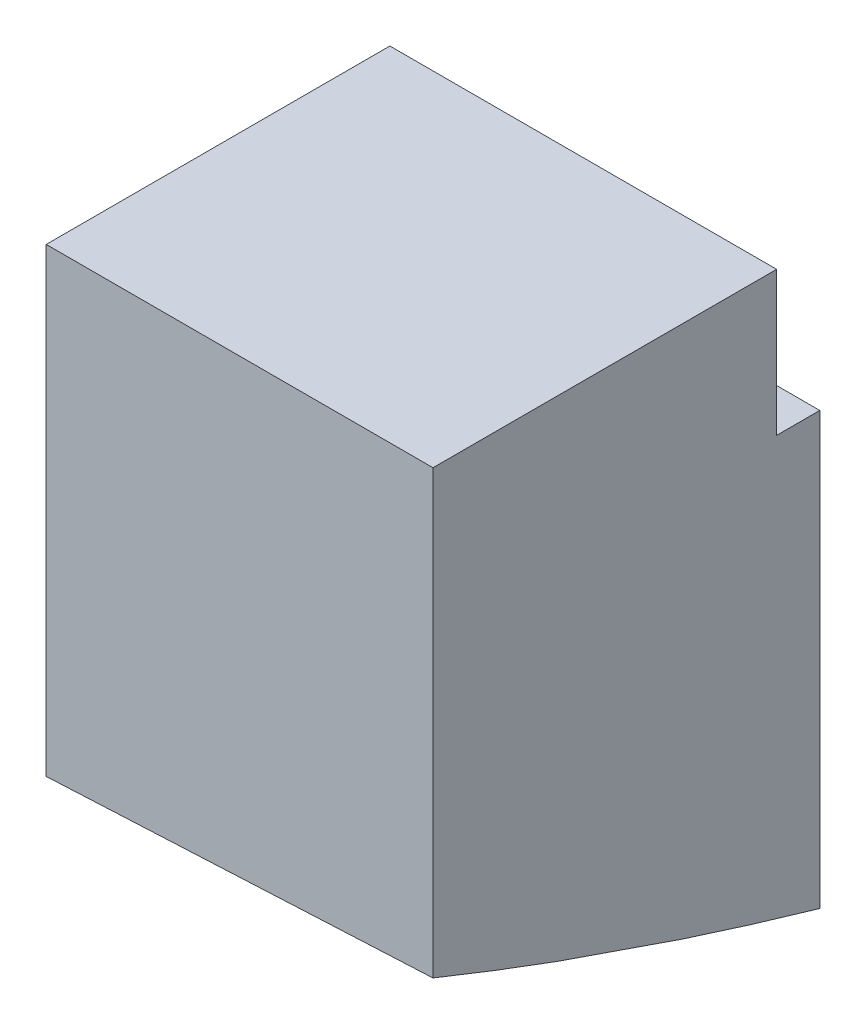
ISO-10303-21;
HEADER;
FILE_DESCRIPTION(('STEP AP214'),'2;1');
FILE_NAME('part.step','',(''),(''),'','','');
FILE_SCHEMA(('AUTOMOTIVE_DESIGN { 1 0 10303 214 1 1 1 1 }'));
ENDSEC;
DATA;
#1=APPLICATION_CONTEXT('core data for automotive mechanical design processes');
#2=APPLICATION_PROTOCOL_DEFINITION('international standard','automotive_design',2000,#1);
#3=PRODUCT_CONTEXT('',#1,'mechanical');
#4=PRODUCT('Part','Part','',(#3));
#5=PRODUCT_RELATED_PRODUCT_CATEGORY('part','',(#4));
#6=PRODUCT_DEFINITION_FORMATION('','',#4);
#7=PRODUCT_DEFINITION_CONTEXT('part definition',#1,'design');
#8=PRODUCT_DEFINITION('design','',#6,#7);
#9=PRODUCT_DEFINITION_SHAPE('','',#8);
#10=(LENGTH_UNIT() NAMED_UNIT(*) SI_UNIT(.MILLI.,.METRE.));
#11=(NAMED_UNIT(*) PLANE_ANGLE_UNIT() SI_UNIT($,.RADIAN.));
#12=(NAMED_UNIT(*) SI_UNIT($,.STERADIAN.) SOLID_ANGLE_UNIT());
#13=UNCERTAINTY_MEASURE_WITH_UNIT(LENGTH_MEASURE(1.E-05),#10,'distance_accuracy_value','');
#14=(GEOMETRIC_REPRESENTATION_CONTEXT(3) GLOBAL_UNCERTAINTY_ASSIGNED_CONTEXT((#13)) GLOBAL_UNIT_ASSIGNED_CONTEXT((#10,
#11,#12)) REPRESENTATION_CONTEXT('',''));
#15=CARTESIAN_POINT('',(0.,0.,0.));
#16=DIRECTION('',(0.,0.,1.));
#17=DIRECTION('',(1.,0.,0.));
#18=AXIS2_PLACEMENT_3D('',#15,#16,#17);
#19=CARTESIAN_POINT('',(0.,50.,0.));
#20=DIRECTION('',(-1.,0.,0.));
#21=DIRECTION('',(0.,0.,1.));
#22=AXIS2_PLACEMENT_3D('',#19,#20,#21);
#23=PLANE('',#22);
#24=DIRECTION('',(0.,-1.,0.));
#25=VECTOR('',#24,1.);
#26=CARTESIAN_POINT('',(0.,50.,0.));
#27=LINE('',#26,#25);
#28=CARTESIAN_POINT('',(0.,50.,0.));
#29=VERTEX_POINT('',#28);
#30=CARTESIAN_POINT('',(0.,19.2653746238792,0.));
#31=VERTEX_POINT('',#30);
#32=EDGE_CURVE('E208',#29,#31,#27,.T.);
#33=ORIENTED_EDGE('',*,*,#32,.T.);
#34=CARTESIAN_POINT('',(0.,19.2653746238792,0.));
#35=CARTESIAN_POINT('',(0.,18.9684224645422,-0.7333824682246));
#36=CARTESIAN_POINT('',(0.,18.6748267536164,-1.46812334043614));
#37=CARTESIAN_POINT('',(0.,18.0944288090762,-2.93995406986249));
#38=CARTESIAN_POINT('',(0.,17.8076239835433,-3.67704290494985));
#39=CARTESIAN_POINT('',(0.,17.24074456179,-5.15354552273353));
#40=CARTESIAN_POINT('',(0.,16.9606679368519,-5.8929585266196));
#41=CARTESIAN_POINT('',(0.,16.4071820554607,-7.37408605737633));
#42=CARTESIAN_POINT('',(0.,16.1337713135788,-8.11580002919308));
#43=CARTESIAN_POINT('',(0.,15.5935553991767,-9.60150635757827));
#44=CARTESIAN_POINT('',(0.,15.3267492645535,-10.3454983643469));
#45=CARTESIAN_POINT('',(0.,14.799681622901,-11.8357379885373));
#46=CARTESIAN_POINT('',(0.,14.5394196573909,-12.5819854438171));
#47=CARTESIAN_POINT('',(0.,14.0253865175721,-14.0766954498029));
#48=CARTESIAN_POINT('',(0.,13.7716152120891,-14.8251579554017));
#49=CARTESIAN_POINT('',(0.,13.2704965915861,-16.3242971547451));
#50=CARTESIAN_POINT('',(0.,13.0231497949205,-17.0749740217453));
#51=CARTESIAN_POINT('',(0.,12.5348209409062,-18.5785232406956));
#52=CARTESIAN_POINT('',(0.,12.2938398737778,-19.3313959142231));
#53=CARTESIAN_POINT('',(0.,11.818184147999,-20.8393183758254));
#54=CARTESIAN_POINT('',(0.,11.5835109321355,-21.5943686189713));
#55=CARTESIAN_POINT('',(0.,11.1204135825164,-23.1066280514065));
#56=CARTESIAN_POINT('',(0.,10.8919913251946,-23.8638378152352));
#57=CARTESIAN_POINT('',(0.,10.4413391600996,-25.3803987759119));
#58=CARTESIAN_POINT('',(0.,10.2191115437309,-26.1397506536947));
#59=CARTESIAN_POINT('',(0.,10.0000000057557,-26.9));
#60=B_SPLINE_CURVE_WITH_KNOTS('',3,(#34,#35,#36,#37,#38,#39,#40,#41,#42,#43,#44,#45,#46,#47,#48,
#49,#50,#51,#52,#53,#54,#55,#56,#57,#58,#59),.UNSPECIFIED.,.F.,.F.,(4,2,2,2,2,2,2,2,2,2,2,2,4),
(0.,2.37365337624956,4.74638568519725,7.11839334153588,9.48986749565518,11.8609941361147,
14.2319541913002,16.6028662921749,18.9739690969661,21.3454385919225,23.717445972261,
26.0901577482283,28.4637358495514),.UNSPECIFIED.);
#61=CARTESIAN_POINT('',(0.,9.99999997053023,-26.9000001221872));
#62=VERTEX_POINT('',#61);
#63=EDGE_CURVE('E143',#31,#62,#60,.T.);
#64=ORIENTED_EDGE('',*,*,#63,.T.);
#65=DIRECTION('',(0.,-1.,0.));
#66=VECTOR('',#65,1.);
#67=CARTESIAN_POINT('',(0.,50.,-26.9));
#68=LINE('',#67,#66);
#69=CARTESIAN_POINT('',(0.,40.,-26.9));
#70=VERTEX_POINT('',#69);
#71=EDGE_CURVE('E198',#70,#62,#68,.T.);
#72=ORIENTED_EDGE('',*,*,#71,.F.);
#73=DIRECTION('',(0.,0.,-1.));
#74=VECTOR('',#73,1.);
#75=CARTESIAN_POINT('',(0.,40.,-26.9));
#76=LINE('',#75,#74);
#77=CARTESIAN_POINT('',(0.,40.,-23.9));
#78=VERTEX_POINT('',#77);
#79=EDGE_CURVE('E225',#78,#70,#76,.T.);
#80=ORIENTED_EDGE('',*,*,#79,.F.);
#81=DIRECTION('',(0.,-1.,0.));
#82=VECTOR('',#81,1.);
#83=CARTESIAN_POINT('',(0.,40.,-23.9));
#84=LINE('',#83,#82);
#85=CARTESIAN_POINT('',(0.,50.,-23.9));
#86=VERTEX_POINT('',#85);
#87=EDGE_CURVE('E216',#86,#78,#84,.T.);
#88=ORIENTED_EDGE('',*,*,#87,.F.);
#89=DIRECTION('',(0.,0.,-1.));
#90=VECTOR('',#89,1.);
#91=CARTESIAN_POINT('',(0.,50.,0.));
#92=LINE('',#91,#90);
#93=EDGE_CURVE('E224',#29,#86,#92,.T.);
#94=ORIENTED_EDGE('',*,*,#93,.F.);
#95=EDGE_LOOP('',(#33,#64,#72,#80,#88,#94));
#96=FACE_BOUND('',#95,.T.);
#97=ADVANCED_FACE('F121',(#96),#23,.F.);
#98=CARTESIAN_POINT('',(0.,50.,-26.9));
#99=DIRECTION('',(0.,0.,1.));
#100=DIRECTION('',(1.,0.,0.));
#101=AXIS2_PLACEMENT_3D('',#98,#99,#100);
#102=PLANE('',#101);
#103=ORIENTED_EDGE('',*,*,#71,.T.);
#104=DIRECTION('',(1.,1.75165169890955E-10,7.2411619053903E-10));
#105=VECTOR('',#104,1.);
#106=CARTESIAN_POINT('',(13.4001487039591,9.99999997287747,-26.900000112484));
#107=LINE('',#106,#105);
#108=CARTESIAN_POINT('',(-26.9,9.99999996583627,-26.9000001416687));
#109=VERTEX_POINT('',#108);
#110=EDGE_CURVE('E183',#109,#62,#107,.T.);
#111=ORIENTED_EDGE('',*,*,#110,.F.);
#112=DIRECTION('',(0.,-1.,0.));
#113=VECTOR('',#112,1.);
#114=CARTESIAN_POINT('',(-26.9,50.,-26.9));
#115=LINE('',#114,#113);
#116=CARTESIAN_POINT('',(-26.9,40.,-26.9));
#117=VERTEX_POINT('',#116);
#118=EDGE_CURVE('E196',#117,#109,#115,.T.);
#119=ORIENTED_EDGE('',*,*,#118,.F.);
#120=DIRECTION('',(1.,0.,0.));
#121=VECTOR('',#120,1.);
#122=CARTESIAN_POINT('',(-40.,40.,-26.9));
#123=LINE('',#122,#121);
#124=EDGE_CURVE('E361',#117,#70,#123,.T.);
#125=ORIENTED_EDGE('',*,*,#124,.T.);
#126=EDGE_LOOP('',(#103,#111,#119,#125));
#127=FACE_BOUND('',#126,.T.);
#128=ADVANCED_FACE('F194',(#127),#102,.F.);
#129=CARTESIAN_POINT('',(-26.9,50.,0.));
#130=DIRECTION('',(1.,0.,0.));
#131=DIRECTION('',(0.,0.,-1.));
#132=AXIS2_PLACEMENT_3D('',#129,#130,#131);
#133=PLANE('',#132);
#134=ORIENTED_EDGE('',*,*,#118,.T.);
#135=CARTESIAN_POINT('',(-26.9,9.99999996583627,-26.9000001416687));
#136=CARTESIAN_POINT('',(-26.9,26.0746138693979,40.0228375132252));
#137=CARTESIAN_POINT('',(-26.9,63.907947180476,90.1089803414481));
#138=CARTESIAN_POINT('',(-26.9,123.499999899071,123.358428343));
#139=B_SPLINE_CURVE_WITH_KNOTS('',3,(#135,#136,#137,#138),.UNSPECIFIED.,.F.,.F.,(4,4),(0.,1.),.UNSPECIFIED.);
#140=CARTESIAN_POINT('',(-26.9,17.9533273908,0.));
#141=VERTEX_POINT('',#140);
#142=EDGE_CURVE('E180',#109,#141,#139,.T.);
#143=ORIENTED_EDGE('',*,*,#142,.T.);
#144=DIRECTION('',(0.,-1.,0.));
#145=VECTOR('',#144,1.);
#146=CARTESIAN_POINT('',(-26.9,50.,0.));
#147=LINE('',#146,#145);
#148=CARTESIAN_POINT('',(-26.9,50.,0.));
#149=VERTEX_POINT('',#148);
#150=EDGE_CURVE('E203',#149,#141,#147,.T.);
#151=ORIENTED_EDGE('',*,*,#150,.F.);
#152=DIRECTION('',(0.,0.,1.));
#153=VECTOR('',#152,1.);
#154=CARTESIAN_POINT('',(-26.9,50.,0.));
#155=LINE('',#154,#153);
#156=CARTESIAN_POINT('',(-26.9,50.,-23.9));
#157=VERTEX_POINT('',#156);
#158=EDGE_CURVE('E233',#157,#149,#155,.T.);
#159=ORIENTED_EDGE('',*,*,#158,.F.);
#160=DIRECTION('',(0.,-1.,0.));
#161=VECTOR('',#160,1.);
#162=CARTESIAN_POINT('',(-26.9,50.,-23.9));
#163=LINE('',#162,#161);
#164=CARTESIAN_POINT('',(-26.9,40.,-23.9));
#165=VERTEX_POINT('',#164);
#166=EDGE_CURVE('E151',#157,#165,#163,.T.);
#167=ORIENTED_EDGE('',*,*,#166,.T.);
#168=DIRECTION('',(0.,0.,-1.));
#169=VECTOR('',#168,1.);
#170=CARTESIAN_POINT('',(-26.9,40.,0.));
#171=LINE('',#170,#169);
#172=EDGE_CURVE('E51',#165,#117,#171,.T.);
#173=ORIENTED_EDGE('',*,*,#172,.T.);
#174=EDGE_LOOP('',(#134,#143,#151,#159,#167,#173));
#175=FACE_BOUND('',#174,.T.);
#176=ADVANCED_FACE('F201',(#175),#133,.F.);
#177=CARTESIAN_POINT('',(0.,50.,0.));
#178=DIRECTION('',(0.,0.,-1.));
#179=DIRECTION('',(-1.,0.,0.));
#180=AXIS2_PLACEMENT_3D('',#177,#178,#179);
#181=PLANE('',#180);
#182=ORIENTED_EDGE('',*,*,#150,.T.);
#183=CARTESIAN_POINT('',(-26.9,17.9533273908,0.));
#184=CARTESIAN_POINT('',(-22.416549526997,18.1696002957464,0.));
#185=CARTESIAN_POINT('',(-17.9331576238289,18.3870740176429,0.));
#186=CARTESIAN_POINT('',(-8.96649095716219,18.8244230953359,0.));
#187=CARTESIAN_POINT('',(-4.48321619366368,19.0442984511325,0.));
#188=CARTESIAN_POINT('',(0.,19.2653746238792,0.));
#189=B_SPLINE_CURVE_WITH_KNOTS('',3,(#183,#184,#185,#186,#187,#188),.UNSPECIFIED.,.F.,.F.,(4,2,
4),(0.,13.4659897517406,26.9319795034813),.UNSPECIFIED.);
#190=EDGE_CURVE('E184',#141,#31,#189,.T.);
#191=ORIENTED_EDGE('',*,*,#190,.T.);
#192=ORIENTED_EDGE('',*,*,#32,.F.);
#193=DIRECTION('',(1.,0.,0.));
#194=VECTOR('',#193,1.);
#195=CARTESIAN_POINT('',(0.,50.,0.));
#196=LINE('',#195,#194);
#197=EDGE_CURVE('E230',#149,#29,#196,.T.);
#198=ORIENTED_EDGE('',*,*,#197,.F.);
#199=EDGE_LOOP('',(#182,#191,#192,#198));
#200=FACE_BOUND('',#199,.T.);
#201=ADVANCED_FACE('F246',(#200),#181,.F.);
#202=CARTESIAN_POINT('',(0.,50.,0.));
#203=DIRECTION('',(0.,1.,0.));
#204=DIRECTION('',(0.,0.,1.));
#205=AXIS2_PLACEMENT_3D('',#202,#203,#204);
#206=PLANE('',#205);
#207=DIRECTION('',(1.,0.,0.));
#208=VECTOR('',#207,1.);
#209=CARTESIAN_POINT('',(0.,50.,-23.9));
#210=LINE('',#209,#208);
#211=EDGE_CURVE('E136',#157,#86,#210,.T.);
#212=ORIENTED_EDGE('',*,*,#211,.F.);
#213=ORIENTED_EDGE('',*,*,#158,.T.);
#214=ORIENTED_EDGE('',*,*,#197,.T.);
#215=ORIENTED_EDGE('',*,*,#93,.T.);
#216=EDGE_LOOP('',(#212,#213,#214,#215));
#217=FACE_BOUND('',#216,.T.);
#218=ADVANCED_FACE('F228',(#217),#206,.T.);
#219=CARTESIAN_POINT('',(-40.,40.,-26.9));
#220=DIRECTION('',(0.,-1.,0.));
#221=DIRECTION('',(0.,0.,-1.));
#222=AXIS2_PLACEMENT_3D('',#219,#220,#221);
#223=PLANE('',#222);
#224=DIRECTION('',(1.,0.,0.));
#225=VECTOR('',#224,1.);
#226=CARTESIAN_POINT('',(-40.,40.,-23.9));
#227=LINE('',#226,#225);
#228=EDGE_CURVE('E359',#165,#78,#227,.T.);
#229=ORIENTED_EDGE('',*,*,#228,.T.);
#230=ORIENTED_EDGE('',*,*,#79,.T.);
#231=ORIENTED_EDGE('',*,*,#124,.F.);
#232=ORIENTED_EDGE('',*,*,#172,.F.);
#233=EDGE_LOOP('',(#229,#230,#231,#232));
#234=FACE_BOUND('',#233,.T.);
#235=ADVANCED_FACE('F272',(#234),#223,.F.);
#236=CARTESIAN_POINT('',(-40.,40.,-23.9));
#237=DIRECTION('',(0.,0.,1.));
#238=DIRECTION('',(1.,0.,0.));
#239=AXIS2_PLACEMENT_3D('',#236,#237,#238);
#240=PLANE('',#239);
#241=ORIENTED_EDGE('',*,*,#211,.T.);
#242=ORIENTED_EDGE('',*,*,#87,.T.);
#243=ORIENTED_EDGE('',*,*,#228,.F.);
#244=ORIENTED_EDGE('',*,*,#166,.F.);
#245=EDGE_LOOP('',(#241,#242,#243,#244));
#246=FACE_BOUND('',#245,.T.);
#247=ADVANCED_FACE('F215',(#246),#240,.F.);
#248=CARTESIAN_POINT('',(-26.9,9.99999996583627,-26.9000001416687));
#249=CARTESIAN_POINT('',(-0.0332341973605724,9.99999997054239,-26.9000001222141));
#250=CARTESIAN_POINT('',(26.8335316052787,9.99999997521979,-26.900000102755));
#251=CARTESIAN_POINT('',(53.7002974079183,9.99999997989695,-26.9000000832959));
#252=CARTESIAN_POINT('',(-26.9,26.0746138693979,40.0228375132252));
#253=CARTESIAN_POINT('',(-6.30994063190102,29.0561515377557,39.2326920734927));
#254=CARTESIAN_POINT('',(14.2801187361979,32.0376892060944,38.4425466337632));
#255=CARTESIAN_POINT('',(34.870178104297,35.0192268744329,37.6524011940338));
#256=CARTESIAN_POINT('',(-26.9,63.907947180476,90.1089803414481));
#257=CARTESIAN_POINT('',(-15.0545013581228,66.8894848518751,89.7221473798471));
#258=CARTESIAN_POINT('',(-3.20900271624572,69.8710225232646,89.3353144182476));
#259=CARTESIAN_POINT('',(8.63649592563149,72.852560194654,88.9484814566481));
#260=CARTESIAN_POINT('',(-26.9,123.499999899071,123.358428343));
#261=CARTESIAN_POINT('',(-26.8999999998797,123.499999912901,123.335579280361));
#262=CARTESIAN_POINT('',(-26.8999999997593,123.499999926731,123.312730217722));
#263=CARTESIAN_POINT('',(-26.899999999639,123.49999994056,123.289881155083));
#264=B_SPLINE_SURFACE_WITH_KNOTS('',3,3,((#248,#249,#250,#251),(#252,#253,#254,#255),(#256,#257,
#258,#259),(#260,#261,#262,#263)),.UNSPECIFIED.,.F.,.F.,.F.,(4,4),(4,4),(0.,1.),(0.,
0.411081774359451),.UNSPECIFIED.);
#265=CARTESIAN_POINT('',(-16.75,11.3397714721433,-21.9));
#266=CARTESIAN_POINT('',(-16.6092233838833,11.3410273522085,-21.9000010291314));
#267=CARTESIAN_POINT('',(-16.4684764280631,11.343888263261,-21.894224505269));
#268=CARTESIAN_POINT('',(-16.1879829502299,11.3528239090695,-21.8711755949902));
#269=CARTESIAN_POINT('',(-16.0482367143829,11.358899528611,-21.8539000433539));
#270=CARTESIAN_POINT('',(-15.7706742418385,11.3742514050822,-21.8079865751276));
#271=CARTESIAN_POINT('',(-15.6328598707084,11.3835305601323,-21.7793383665857));
#272=CARTESIAN_POINT('',(-15.360219024703,11.405246883129,-21.7109242214435));
#273=CARTESIAN_POINT('',(-15.2253936821208,11.4176852263307,-21.6711541468211));
#274=CARTESIAN_POINT('',(-14.9599472021264,11.4456254968352,-21.5809243494584));
#275=CARTESIAN_POINT('',(-14.8293195259806,11.4611223610721,-21.5304822832975));
#276=CARTESIAN_POINT('',(-14.5728796715879,11.4951060677878,-21.4192811310118));
#277=CARTESIAN_POINT('',(-14.4470692842551,11.5135940091595,-21.3585182527094));
#278=CARTESIAN_POINT('',(-14.2012207551592,11.5534291584476,-21.2272349062098));
#279=CARTESIAN_POINT('',(-14.0811792417819,11.5747746679484,-21.1567202332433));
#280=CARTESIAN_POINT('',(-13.8475121507124,11.620206696445,-21.0064501104097));
#281=CARTESIAN_POINT('',(-13.7338889996862,11.6442942419131,-20.9266911997878));
#282=CARTESIAN_POINT('',(-13.5120848222654,11.695447063061,-20.7572663537278));
#283=CARTESIAN_POINT('',(-13.4040165294816,11.7225529752249,-20.6674651260819));
#284=CARTESIAN_POINT('',(-13.1958862927644,11.7792587879505,-20.4796689083641));
#285=CARTESIAN_POINT('',(-13.0958272859916,11.8088595953433,-20.3816709390843));
#286=CARTESIAN_POINT('',(-12.9043579285295,11.8703463641778,-20.1782708584627));
#287=CARTESIAN_POINT('',(-12.8129457572335,11.9022318420821,-20.0728703139265));
#288=CARTESIAN_POINT('',(-12.6392171441323,11.9680984068618,-19.8553734615869));
#289=CARTESIAN_POINT('',(-12.5569041425056,12.0020802788196,-19.7432746458357));
#290=CARTESIAN_POINT('',(-12.3989438536369,12.0732166271295,-19.5088982775189));
#291=CARTESIAN_POINT('',(-12.3236605653629,12.1104422049667,-19.3863969005133));
#292=CARTESIAN_POINT('',(-12.183764145483,12.1866618094968,-19.1359122967329));
#293=CARTESIAN_POINT('',(-12.1191550380658,12.2256564961179,-19.0079270253142));
#294=CARTESIAN_POINT('',(-12.0009781164076,12.3051307211138,-18.7474340593866));
#295=CARTESIAN_POINT('',(-11.9474082668856,12.3456099841569,-18.6149272037715));
#296=CARTESIAN_POINT('',(-11.8515360583465,12.4278029367549,-18.3462169420878));
#297=CARTESIAN_POINT('',(-11.809237710558,12.4695170599118,-18.2100122390031));
#298=CARTESIAN_POINT('',(-11.7346754206899,12.5555647600994,-17.9293752114098));
#299=CARTESIAN_POINT('',(-11.702876480571,12.5999365857852,-17.7848309154167));
#300=CARTESIAN_POINT('',(-11.6518468938041,12.6893816610396,-17.4937534063485));
#301=CARTESIAN_POINT('',(-11.632616590583,12.7344549297399,-17.3472201390382));
#302=CARTESIAN_POINT('',(-11.6068083245754,12.8249915957309,-17.0531125385625));
#303=CARTESIAN_POINT('',(-11.6002343450779,12.8704551113223,-16.9055378923088));
#304=CARTESIAN_POINT('',(-11.5997780367896,12.961411577923,-16.610432964573));
#305=CARTESIAN_POINT('',(-11.6058914995882,13.0069045141697,-16.4629026846091));
#306=CARTESIAN_POINT('',(-11.6310757483225,13.0987101836788,-16.1652190388087));
#307=CARTESIAN_POINT('',(-11.6504600459356,13.1450157252232,-16.015089863101));
#308=CARTESIAN_POINT('',(-11.7024022215676,13.2369367697628,-15.7169746628165));
#309=CARTESIAN_POINT('',(-11.7349552971776,13.2825525180285,-15.5689878773059));
#310=CARTESIAN_POINT('',(-11.8130891166315,13.3727594229241,-15.2760959254249));
#311=CARTESIAN_POINT('',(-11.8586755920383,13.4173501194363,-15.1311921450232));
#312=CARTESIAN_POINT('',(-11.9626154847671,13.5050912762033,-14.8456567676311));
#313=CARTESIAN_POINT('',(-12.0209637106349,13.5482423139054,-14.7050234598374));
#314=CARTESIAN_POINT('',(-12.1497305157403,13.6324845457969,-14.4298815060359));
#315=CARTESIAN_POINT('',(-12.2200729532212,13.673586740309,-14.2953406148909));
#316=CARTESIAN_POINT('',(-12.3726510407826,13.7536226411455,-14.0325771972644));
#317=CARTESIAN_POINT('',(-12.4548816911401,13.7925572495857,-13.9043520448703));
#318=CARTESIAN_POINT('',(-12.6308014179729,13.8679171731594,-13.6551705953812));
#319=CARTESIAN_POINT('',(-12.7244937166229,13.9043417781444,-13.5342163566522));
#320=CARTESIAN_POINT('',(-12.9226915880117,13.9742912846007,-13.3007028961386));
#321=CARTESIAN_POINT('',(-13.0271922429745,14.0078174921989,-13.1881398961285));
#322=CARTESIAN_POINT('',(-13.2422303023791,14.0704404927071,-12.9764130920382));
#323=CARTESIAN_POINT('',(-13.3523941746835,14.0996562700308,-12.8769050384102));
#324=CARTESIAN_POINT('',(-13.5813552755372,14.1547890618448,-12.6874567564216));
#325=CARTESIAN_POINT('',(-13.7001487370796,14.1807075022626,-12.5975123950411));
#326=CARTESIAN_POINT('',(-13.9455767274278,14.2289884275603,-12.4279687593907));
#327=CARTESIAN_POINT('',(-14.0722108525916,14.2513510952822,-12.3483689532297));
#328=CARTESIAN_POINT('',(-14.3323932619692,14.2922820436979,-12.2002657447126));
#329=CARTESIAN_POINT('',(-14.4659412604681,14.3108504810312,-12.1317618843));
#330=CARTESIAN_POINT('',(-14.7320404622988,14.3431568595515,-12.0096754208411));
#331=CARTESIAN_POINT('',(-14.8643030713656,14.3570909958132,-11.9555150549355));
#332=CARTESIAN_POINT('',(-15.1332270251085,14.3812256956081,-11.8582728590071));
#333=CARTESIAN_POINT('',(-15.2698898670964,14.3914249733187,-11.8151948458884));
#334=CARTESIAN_POINT('',(-15.5464692408795,14.4079826761145,-11.7405569890232));
#335=CARTESIAN_POINT('',(-15.6863838674217,14.4143432941889,-11.7089905728995));
#336=CARTESIAN_POINT('',(-15.9685310836295,14.4231826645534,-11.6576160584408));
#337=CARTESIAN_POINT('',(-16.1107644941922,14.425660010548,-11.6378122214405));
#338=CARTESIAN_POINT('',(-16.3914619693791,14.4267035419659,-11.6106282667452));
#339=CARTESIAN_POINT('',(-16.5298864511983,14.4254019188746,-11.6028424959297));
#340=CARTESIAN_POINT('',(-16.8068824851691,14.419203175874,-11.5984510017066));
#341=CARTESIAN_POINT('',(-16.9454540722356,14.4143047685887,-11.6018492828587));
#342=CARTESIAN_POINT('',(-17.2216442754224,14.4009852355508,-11.6197763419045));
#343=CARTESIAN_POINT('',(-17.359263269143,14.3925655977801,-11.6343004204744));
#344=CARTESIAN_POINT('',(-17.6326911734313,14.3723063834514,-11.6743271526103));
#345=CARTESIAN_POINT('',(-17.7684993902073,14.3604655333483,-11.6998338962058));
#346=CARTESIAN_POINT('',(-18.0371384903604,14.3335210335611,-11.7615390065896));
#347=CARTESIAN_POINT('',(-18.1699731200026,14.3184217779145,-11.7977229987631));
#348=CARTESIAN_POINT('',(-18.4320148602181,14.2851093203785,-11.8804813113664));
#349=CARTESIAN_POINT('',(-18.5612206391079,14.2668949922906,-11.9270593914553));
#350=CARTESIAN_POINT('',(-18.8150857549947,14.2275480481837,-12.0301816395136));
#351=CARTESIAN_POINT('',(-18.939746382539,14.2064162688307,-12.08672295151));
#352=CARTESIAN_POINT('',(-19.1838299956894,14.161426648536,-12.2093354211199));
#353=CARTESIAN_POINT('',(-19.3032509912643,14.1375677840303,-12.275410159396));
#354=CARTESIAN_POINT('',(-19.5394859704843,14.0866142053797,-12.4186159078734));
#355=CARTESIAN_POINT('',(-19.6561233958277,14.0594456156533,-12.4960123761045));
#356=CARTESIAN_POINT('',(-19.8823595712206,14.0027009762636,-12.6597247158994));
#357=CARTESIAN_POINT('',(-19.9919557149015,13.9731240442203,-12.746043859746));
#358=CARTESIAN_POINT('',(-20.3091338748963,13.881166851255,-13.0173951982371));
#359=CARTESIAN_POINT('',(-20.5053029030465,13.8155173190544,-13.2149415732674));
#360=CARTESIAN_POINT('',(-20.8701101809481,13.6746634812446,-13.6466836614273));
#361=CARTESIAN_POINT('',(-21.0371856591863,13.5991682884524,-13.882097182073));
#362=CARTESIAN_POINT('',(-21.3293120385534,13.4432808284524,-14.3762219242249));
#363=CARTESIAN_POINT('',(-21.454354536598,13.3628875858341,-14.6349377911613));
#364=CARTESIAN_POINT('',(-21.6634861398843,13.1962619258762,-15.1789738252314));
#365=CARTESIAN_POINT('',(-21.7458586463285,13.1099236121994,-15.4649285478122));
#366=CARTESIAN_POINT('',(-21.8316848292013,12.9800452724167,-15.9008673754279));
#367=CARTESIAN_POINT('',(-21.8540067814079,12.9366653020623,-16.0474355361644));
#368=CARTESIAN_POINT('',(-21.8859437469331,12.8500363695338,-16.3419730887792));
#369=CARTESIAN_POINT('',(-21.8955633335307,12.8067873658058,-16.4899419570204));
#370=CARTESIAN_POINT('',(-21.9020619133115,12.719933452137,-16.7888761064129));
#371=CARTESIAN_POINT('',(-21.8987135790124,12.6763356851639,-16.9398482704257));
#372=CARTESIAN_POINT('',(-21.8787550992765,12.589849957095,-17.2410611013292));
#373=CARTESIAN_POINT('',(-21.8621498357285,12.5469617406392,-17.3913020170166));
#374=CARTESIAN_POINT('',(-21.8157312879739,12.4621369669725,-17.6900694877959));
#375=CARTESIAN_POINT('',(-21.785912719339,12.4202007975771,-17.838595332566));
#376=CARTESIAN_POINT('',(-21.7132200398633,12.3375833359429,-18.1327087903938));
#377=CARTESIAN_POINT('',(-21.670351148075,12.2969015492041,-18.2782975532694));
#378=CARTESIAN_POINT('',(-21.5721447943986,12.2173362229911,-18.5644220106339));
#379=CARTESIAN_POINT('',(-21.5169023541272,12.1784415671379,-18.7049872151992));
#380=CARTESIAN_POINT('',(-21.3941047341818,12.1023993981235,-18.9810545414159));
#381=CARTESIAN_POINT('',(-21.3265545650594,12.0652511816902,-19.1165586964993));
#382=CARTESIAN_POINT('',(-21.1795062383429,11.9929224213408,-19.3815278180922));
#383=CARTESIAN_POINT('',(-21.1000047763756,11.9577424253142,-19.5109911013682));
#384=CARTESIAN_POINT('',(-20.9296002756023,11.8896170253789,-19.7627284677235));
#385=CARTESIAN_POINT('',(-20.8387021093928,11.8566706757074,-19.8850055905848));
#386=CARTESIAN_POINT('',(-20.6487044974762,11.7940961679046,-20.1181746245811));
#387=CARTESIAN_POINT('',(-20.5498960481025,11.7644020521691,-20.2292859893171));
#388=CARTESIAN_POINT('',(-20.3427214251891,11.7075550304419,-20.4428271510815));
#389=CARTESIAN_POINT('',(-20.2343593603714,11.6804010422738,-20.5452606433923));
#390=CARTESIAN_POINT('',(-20.0087218960284,11.6288060914966,-20.7406789386798));
#391=CARTESIAN_POINT('',(-19.8914418858393,11.6043665485702,-20.8336587951777));
#392=CARTESIAN_POINT('',(-19.6489010552258,11.5584150035473,-21.0092577907442));
#393=CARTESIAN_POINT('',(-19.5236436800927,11.5369017500554,-21.0918813573715));
#394=CARTESIAN_POINT('',(-19.2704960240279,11.4976585290678,-21.2433951958463));
#395=CARTESIAN_POINT('',(-19.1428474097248,11.4798232899548,-21.3126621617624));
#396=CARTESIAN_POINT('',(-18.8818929699577,11.4471832110683,-21.4402684280997));
#397=CARTESIAN_POINT('',(-18.7485895623431,11.4323770915765,-21.4986123423173));
#398=CARTESIAN_POINT('',(-18.4773982462571,11.4059283725359,-21.6038360371624));
#399=CARTESIAN_POINT('',(-18.339515630535,11.3942822542563,-21.650728563294));
#400=CARTESIAN_POINT('',(-18.0601045727796,11.3742436342581,-21.7327021505954));
#401=CARTESIAN_POINT('',(-17.9185772742905,11.3658501249613,-21.7677868690894));
#402=CARTESIAN_POINT('',(-17.6072094110723,11.3511902610711,-21.8310680736614));
#403=CARTESIAN_POINT('',(-17.4368507117224,11.3455770968158,-21.8568941771228));
#404=CARTESIAN_POINT('',(-17.094313207862,11.339099925692,-21.8913593799964));
#405=CARTESIAN_POINT('',(-16.9221344311612,11.3382358463653,-21.8999987416309));
#406=CARTESIAN_POINT('',(-16.75,11.3397714721433,-21.9));
#407=B_SPLINE_CURVE_WITH_KNOTS('',3,(#265,#266,#267,#268,#269,#270,#271,#272,#273,#274,#275,
#276,#277,#278,#279,#280,#281,#282,#283,#284,#285,#286,#287,#288,#289,#290,#291,#292,#293,#294,
#295,#296,#297,#298,#299,#300,#301,#302,#303,#304,#305,#306,#307,#308,#309,#310,#311,#312,#313,
#314,#315,#316,#317,#318,#319,#320,#321,#322,#323,#324,#325,#326,#327,#328,#329,#330,#331,#332,
#333,#334,#335,#336,#337,#338,#339,#340,#341,#342,#343,#344,#345,#346,#347,#348,#349,#350,#351,
#352,#353,#354,#355,#356,#357,#358,#359,#360,#361,#362,#363,#364,#365,#366,#367,#368,#369,#370,
#371,#372,#373,#374,#375,#376,#377,#378,#379,#380,#381,#382,#383,#384,#385,#386,#387,#388,#389,
#390,#391,#392,#393,#394,#395,#396,#397,#398,#399,#400,#401,#402,#403,#404,#405,#406),
.UNSPECIFIED.,.T.,.F.,(4,2,2,2,2,2,2,2,2,2,2,2,2,2,2,2,2,2,2,2,2,2,2,2,2,2,2,2,2,2,2,2,2,2,2,2,
2,2,2,2,2,2,2,2,2,2,2,2,2,2,2,2,2,2,2,2,2,2,2,2,2,2,2,2,2,2,2,2,2,2,4),(0.,0.4221928792219,
0.844502019245107,1.26719421223984,1.69004388259313,2.11219935296049,2.53451027285952,
2.95657129458799,3.37879083632249,3.80760569841531,4.23657710159221,4.66545798209389,
5.09450046159923,5.53957457564866,5.98481610256509,6.4299754678005,6.87529304252767,
7.33828872915765,7.80129706621013,8.26445110076583,8.72745153219891,9.20178548352795,
9.67594660978247,10.1503165745224,10.624493924253,11.0957661265247,11.5668407033935,
12.0380480175307,12.5090418688603,12.9623666625377,13.4154947454475,13.8685995204254,
14.3216855858254,14.751950677908,15.1823637610066,15.612530719926,16.0428534243751,
16.458306396579,16.8739081419845,17.289334441898,17.7049155837717,18.1199397681343,
18.5351143154703,18.9501700455261,19.3653820742714,19.7926579666618,20.2200911170093,
21.0742606747383,21.9654712741399,22.8568599353898,23.7817642995421,24.2447562202252,
24.7075814027485,25.1785563168472,25.6493578735134,26.1203478891351,26.5911497945075,
27.0584531543137,27.5255666954157,27.9928096255307,28.4598534654625,28.9141698673632,
29.3682918258072,29.8226501872699,30.2768136324034,30.7152383223012,31.1534774057746,
31.5912264788661,32.0288398394721,32.5450835306392,33.0613193452928),.UNSPECIFIED.);
#408=CARTESIAN_POINT('',(-16.75,11.3397714721433,-21.9));
#409=VERTEX_POINT('',#408);
#410=EDGE_CURVE('E125',#409,#409,#407,.T.);
#411=ORIENTED_EDGE('',*,*,#410,.F.);
#412=EDGE_LOOP('',(#411));
#413=FACE_BOUND('',#412,.T.);
#414=ORIENTED_EDGE('',*,*,#63,.F.);
#415=ORIENTED_EDGE('',*,*,#190,.F.);
#416=ORIENTED_EDGE('',*,*,#142,.F.);
#417=ORIENTED_EDGE('',*,*,#110,.T.);
#418=EDGE_LOOP('',(#414,#415,#416,#417));
#419=FACE_BOUND('',#418,.T.);
#420=ADVANCED_FACE('F182',(#413,#419),#264,.F.);
#421=CARTESIAN_POINT('',(-16.75,40.,-16.75));
#422=DIRECTION('',(0.,-1.,0.));
#423=DIRECTION('',(0.,0.,-1.));
#424=AXIS2_PLACEMENT_3D('',#421,#422,#423);
#425=PLANE('',#424);
#426=CARTESIAN_POINT('',(-16.75,40.,-16.75));
#427=DIRECTION('',(0.,-1.,0.));
#428=DIRECTION('',(0.,0.,-1.));
#429=AXIS2_PLACEMENT_3D('',#426,#427,#428);
#430=CIRCLE('',#429,5.15);
#431=CARTESIAN_POINT('',(-16.75,40.,-21.9));
#432=VERTEX_POINT('',#431);
#433=EDGE_CURVE('E234',#432,#432,#430,.T.);
#434=ORIENTED_EDGE('',*,*,#433,.T.);
#435=EDGE_LOOP('',(#434));
#436=FACE_BOUND('',#435,.T.);
#437=ADVANCED_FACE('F270',(#436),#425,.T.);
#438=CARTESIAN_POINT('',(-16.75,40.,-16.75));
#439=DIRECTION('',(0.,-1.,0.));
#440=DIRECTION('',(0.,0.,-1.));
#441=AXIS2_PLACEMENT_3D('',#438,#439,#440);
#442=CYLINDRICAL_SURFACE('',#441,5.15);
#443=ORIENTED_EDGE('',*,*,#410,.T.);
#444=EDGE_LOOP('',(#443));
#445=FACE_BOUND('',#444,.T.);
#446=ORIENTED_EDGE('',*,*,#433,.F.);
#447=EDGE_LOOP('',(#446));
#448=FACE_BOUND('',#447,.T.);
#449=ADVANCED_FACE('F286',(#445,#448),#442,.F.);
#450=CLOSED_SHELL('',(#97,#128,#176,#201,#218,#235,#247,#420,#437,#449));
#451=MANIFOLD_SOLID_BREP('B6',#450);
#452=ADVANCED_BREP_SHAPE_REPRESENTATION('',(#18,#451),#14);
#453=SHAPE_DEFINITION_REPRESENTATION(#9,#452);
ENDSEC;
END-ISO-10303-21;
